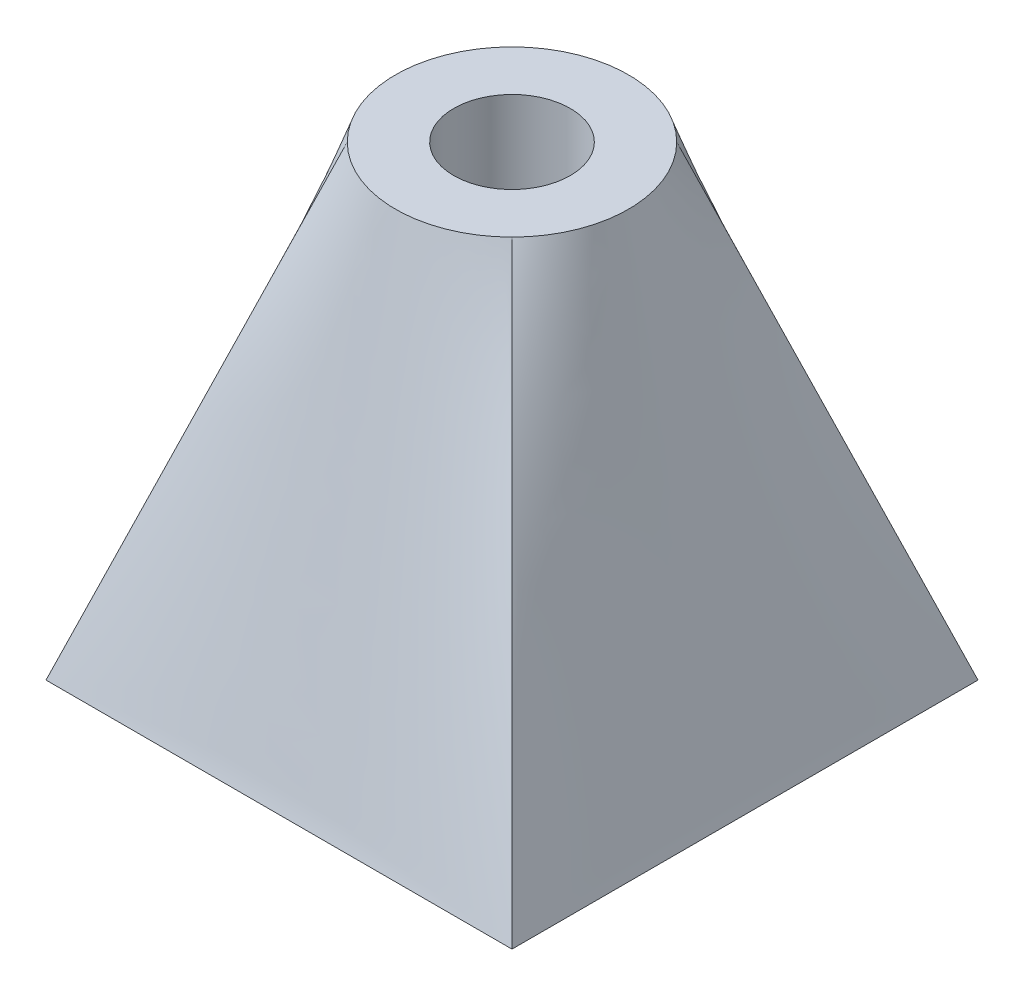
ISO-10303-21;
HEADER;
FILE_DESCRIPTION(('STEP AP214'),'2;1');
FILE_NAME('part.step','',(''),(''),'','','');
FILE_SCHEMA(('AUTOMOTIVE_DESIGN { 1 0 10303 214 1 1 1 1 }'));
ENDSEC;
DATA;
#1=APPLICATION_CONTEXT('core data for automotive mechanical design processes');
#2=APPLICATION_PROTOCOL_DEFINITION('international standard','automotive_design',2000,#1);
#3=PRODUCT_CONTEXT('',#1,'mechanical');
#4=PRODUCT('Part','Part','',(#3));
#5=PRODUCT_RELATED_PRODUCT_CATEGORY('part','',(#4));
#6=PRODUCT_DEFINITION_FORMATION('','',#4);
#7=PRODUCT_DEFINITION_CONTEXT('part definition',#1,'design');
#8=PRODUCT_DEFINITION('design','',#6,#7);
#9=PRODUCT_DEFINITION_SHAPE('','',#8);
#10=(LENGTH_UNIT() NAMED_UNIT(*) SI_UNIT(.MILLI.,.METRE.));
#11=(NAMED_UNIT(*) PLANE_ANGLE_UNIT() SI_UNIT($,.RADIAN.));
#12=(NAMED_UNIT(*) SI_UNIT($,.STERADIAN.) SOLID_ANGLE_UNIT());
#13=UNCERTAINTY_MEASURE_WITH_UNIT(LENGTH_MEASURE(1.E-05),#10,'distance_accuracy_value','');
#14=(GEOMETRIC_REPRESENTATION_CONTEXT(3) GLOBAL_UNCERTAINTY_ASSIGNED_CONTEXT((#13)) GLOBAL_UNIT_ASSIGNED_CONTEXT((#10,
#11,#12)) REPRESENTATION_CONTEXT('',''));
#15=CARTESIAN_POINT('',(0.,0.,0.));
#16=DIRECTION('',(0.,0.,1.));
#17=DIRECTION('',(1.,0.,0.));
#18=AXIS2_PLACEMENT_3D('',#15,#16,#17);
#19=CARTESIAN_POINT('',(20.,40.,-20.));
#20=DIRECTION('',(0.,1.,0.));
#21=DIRECTION('',(0.,0.,1.));
#22=AXIS2_PLACEMENT_3D('',#19,#20,#21);
#23=PLANE('',#22);
#24=CARTESIAN_POINT('',(20.,40.,-20.));
#25=DIRECTION('',(0.,1.,0.));
#26=DIRECTION('',(0.,0.,1.));
#27=AXIS2_PLACEMENT_3D('',#24,#25,#26);
#28=CIRCLE('',#27,5.);
#29=CARTESIAN_POINT('',(20.,40.,-15.));
#30=VERTEX_POINT('',#29);
#31=EDGE_CURVE('E301',#30,#30,#28,.T.);
#32=ORIENTED_EDGE('',*,*,#31,.F.);
#33=EDGE_LOOP('',(#32));
#34=FACE_BOUND('',#33,.T.);
#35=CARTESIAN_POINT('',(20.,40.,-20.));
#36=DIRECTION('',(0.,1.,0.));
#37=DIRECTION('',(0.,0.,1.));
#38=AXIS2_PLACEMENT_3D('',#35,#36,#37);
#39=CIRCLE('',#38,10.);
#40=CARTESIAN_POINT('',(12.9289321881345,40.,-27.0710678118655));
#41=VERTEX_POINT('',#40);
#42=CARTESIAN_POINT('',(12.9289321881345,40.,-12.9289321881345));
#43=VERTEX_POINT('',#42);
#44=EDGE_CURVE('E12',#41,#43,#39,.T.);
#45=ORIENTED_EDGE('',*,*,#44,.T.);
#46=CARTESIAN_POINT('',(27.0710678118655,40.,-12.9289321881345));
#47=VERTEX_POINT('',#46);
#48=EDGE_CURVE('E78',#43,#47,#39,.T.);
#49=ORIENTED_EDGE('',*,*,#48,.T.);
#50=CARTESIAN_POINT('',(27.0710678118655,40.,-27.0710678118655));
#51=VERTEX_POINT('',#50);
#52=EDGE_CURVE('E211',#47,#51,#39,.T.);
#53=ORIENTED_EDGE('',*,*,#52,.T.);
#54=EDGE_CURVE('E203',#51,#41,#39,.T.);
#55=ORIENTED_EDGE('',*,*,#54,.T.);
#56=EDGE_LOOP('',(#45,#49,#53,#55));
#57=FACE_BOUND('',#56,.T.);
#58=ADVANCED_FACE('F69',(#34,#57),#23,.T.);
#59=CARTESIAN_POINT('',(0.,0.,0.));
#60=DIRECTION('',(0.,-1.,0.));
#61=DIRECTION('',(0.,0.,-1.));
#62=AXIS2_PLACEMENT_3D('',#59,#60,#61);
#63=PLANE('',#62);
#64=CARTESIAN_POINT('',(20.,0.,-20.));
#65=DIRECTION('',(0.,-1.,0.));
#66=DIRECTION('',(0.,0.,-1.));
#67=AXIS2_PLACEMENT_3D('',#64,#65,#66);
#68=CIRCLE('',#67,5.);
#69=CARTESIAN_POINT('',(20.,0.,-25.));
#70=VERTEX_POINT('',#69);
#71=EDGE_CURVE('E73',#70,#70,#68,.T.);
#72=ORIENTED_EDGE('',*,*,#71,.F.);
#73=EDGE_LOOP('',(#72));
#74=FACE_BOUND('',#73,.T.);
#75=DIRECTION('',(0.,0.,1.));
#76=VECTOR('',#75,1.);
#77=CARTESIAN_POINT('',(0.,0.,0.));
#78=LINE('',#77,#76);
#79=CARTESIAN_POINT('',(0.,0.,-40.));
#80=VERTEX_POINT('',#79);
#81=CARTESIAN_POINT('',(0.,0.,0.));
#82=VERTEX_POINT('',#81);
#83=EDGE_CURVE('E116',#80,#82,#78,.T.);
#84=ORIENTED_EDGE('',*,*,#83,.F.);
#85=DIRECTION('',(-1.,0.,0.));
#86=VECTOR('',#85,1.);
#87=CARTESIAN_POINT('',(0.,0.,-40.));
#88=LINE('',#87,#86);
#89=CARTESIAN_POINT('',(40.,0.,-40.));
#90=VERTEX_POINT('',#89);
#91=EDGE_CURVE('E134',#90,#80,#88,.T.);
#92=ORIENTED_EDGE('',*,*,#91,.F.);
#93=DIRECTION('',(0.,0.,-1.));
#94=VECTOR('',#93,1.);
#95=CARTESIAN_POINT('',(40.,0.,0.));
#96=LINE('',#95,#94);
#97=CARTESIAN_POINT('',(40.,0.,0.));
#98=VERTEX_POINT('',#97);
#99=EDGE_CURVE('E118',#98,#90,#96,.T.);
#100=ORIENTED_EDGE('',*,*,#99,.F.);
#101=DIRECTION('',(1.,0.,0.));
#102=VECTOR('',#101,1.);
#103=CARTESIAN_POINT('',(0.,0.,0.));
#104=LINE('',#103,#102);
#105=EDGE_CURVE('E111',#82,#98,#104,.T.);
#106=ORIENTED_EDGE('',*,*,#105,.F.);
#107=EDGE_LOOP('',(#84,#92,#100,#106));
#108=FACE_BOUND('',#107,.T.);
#109=ADVANCED_FACE('F114',(#74,#108),#63,.T.);
#110=CARTESIAN_POINT('',(0.,0.,0.));
#111=CARTESIAN_POINT('',(12.9289321881345,40.,-12.9289321881345));
#112=CARTESIAN_POINT('',(1.66666666666666,0.,0.));
#113=CARTESIAN_POINT('',(13.3455988548012,40.,-12.5122655214679));
#114=CARTESIAN_POINT('',(3.33333333333332,0.,0.));
#115=CARTESIAN_POINT('',(13.8148880901744,40.,-12.1170577036388));
#116=CARTESIAN_POINT('',(6.66666666666665,0.,0.));
#117=CARTESIAN_POINT('',(14.8524201958563,40.,-11.4035582509507));
#118=CARTESIAN_POINT('',(8.33333333333331,0.,0.));
#119=CARTESIAN_POINT('',(15.420716050355,40.,-11.0854976289514));
#120=CARTESIAN_POINT('',(11.6666666666666,0.,0.));
#121=CARTESIAN_POINT('',(16.6357369996636,40.,-10.5596648110634));
#122=CARTESIAN_POINT('',(13.3333333333333,0.,0.));
#123=CARTESIAN_POINT('',(17.2823669694459,40.,-10.3521503508506));
#124=CARTESIAN_POINT('',(16.6666666666667,0.,0.));
#125=CARTESIAN_POINT('',(18.619443541447,40.,-10.0722310660401));
#126=CARTESIAN_POINT('',(18.3333333333333,0.,0.));
#127=CARTESIAN_POINT('',(19.3096440627115,40.,-10.));
#128=CARTESIAN_POINT('',(21.6666666666667,0.,0.));
#129=CARTESIAN_POINT('',(20.6903559372885,40.,-10.));
#130=CARTESIAN_POINT('',(23.3333333333333,0.,0.));
#131=CARTESIAN_POINT('',(21.380556458553,40.,-10.0722310660401));
#132=CARTESIAN_POINT('',(26.6666666666667,0.,0.));
#133=CARTESIAN_POINT('',(22.7176330305541,40.,-10.3521503508506));
#134=CARTESIAN_POINT('',(28.3333333333333,0.,0.));
#135=CARTESIAN_POINT('',(23.3642630003365,40.,-10.5596648110634));
#136=CARTESIAN_POINT('',(31.6666666666667,0.,0.));
#137=CARTESIAN_POINT('',(24.579283949645,40.,-11.0854976289514));
#138=CARTESIAN_POINT('',(33.3333333333333,0.,0.));
#139=CARTESIAN_POINT('',(25.1475798041437,40.,-11.4035582509507));
#140=CARTESIAN_POINT('',(36.6666666666667,0.,0.));
#141=CARTESIAN_POINT('',(26.1851119098256,40.,-12.1170577036388));
#142=CARTESIAN_POINT('',(38.3333333333333,0.,0.));
#143=CARTESIAN_POINT('',(26.6544011451988,40.,-12.5122655214679));
#144=CARTESIAN_POINT('',(40.,0.,0.));
#145=CARTESIAN_POINT('',(27.0710678118655,40.,-12.9289321881345));
#146=B_SPLINE_SURFACE_WITH_KNOTS('',3,1,((#110,#111),(#112,#113),(#114,#115),(#116,#117),(#118,
#119),(#120,#121),(#122,#123),(#124,#125),(#126,#127),(#128,#129),(#130,#131),(#132,#133),(#134,
#135),(#136,#137),(#138,#139),(#140,#141),(#142,#143),(#144,#145)),.UNSPECIFIED.,.F.,.F.,.F.,(4,
2,2,2,2,2,2,2,4),(2,2),(0.,0.125,0.249999999999999,0.374999999999999,0.5,0.624999999999999,0.75,
0.875,1.),(0.,1.),.UNSPECIFIED.);
#147=DIRECTION('',(-0.2939673554626,0.909486881623177,-0.2939673554626));
#148=VECTOR('',#147,1.);
#149=CARTESIAN_POINT('',(33.5355339059327,20.,-6.46446609406726));
#150=LINE('',#149,#148);
#151=EDGE_CURVE('E140',#98,#47,#150,.T.);
#152=DIRECTION('',(-0.2939673554626,-0.909486881623177,0.2939673554626));
#153=VECTOR('',#152,1.);
#154=CARTESIAN_POINT('',(6.46446609406726,20.,-6.46446609406726));
#155=LINE('',#154,#153);
#156=EDGE_CURVE('E124',#43,#82,#155,.T.);
#157=ORIENTED_EDGE('',*,*,#105,.T.);
#158=ORIENTED_EDGE('',*,*,#151,.T.);
#159=ORIENTED_EDGE('',*,*,#48,.F.);
#160=ORIENTED_EDGE('',*,*,#156,.T.);
#161=EDGE_LOOP('',(#157,#158,#159,#160));
#162=FACE_BOUND('',#161,.T.);
#163=ADVANCED_FACE('F138',(#162),#146,.T.);
#164=CARTESIAN_POINT('',(40.,0.,0.));
#165=CARTESIAN_POINT('',(27.0710678118655,40.,-12.9289321881345));
#166=CARTESIAN_POINT('',(40.,0.,-1.66666666666666));
#167=CARTESIAN_POINT('',(27.4877344785321,40.,-13.3455988548012));
#168=CARTESIAN_POINT('',(40.,0.,-3.33333333333331));
#169=CARTESIAN_POINT('',(27.8829422963612,40.,-13.8148880901744));
#170=CARTESIAN_POINT('',(40.,0.,-6.66666666666663));
#171=CARTESIAN_POINT('',(28.5964417490493,40.,-14.8524201958563));
#172=CARTESIAN_POINT('',(40.,0.,-8.33333333333329));
#173=CARTESIAN_POINT('',(28.9145023710486,40.,-15.420716050355));
#174=CARTESIAN_POINT('',(40.,0.,-11.6666666666666));
#175=CARTESIAN_POINT('',(29.4403351889366,40.,-16.6357369996636));
#176=CARTESIAN_POINT('',(40.,0.,-13.3333333333333));
#177=CARTESIAN_POINT('',(29.6478496491494,40.,-17.2823669694459));
#178=CARTESIAN_POINT('',(40.,0.,-16.6666666666666));
#179=CARTESIAN_POINT('',(29.9277689339599,40.,-18.619443541447));
#180=CARTESIAN_POINT('',(40.,0.,-18.3333333333333));
#181=CARTESIAN_POINT('',(30.,40.,-19.3096440627115));
#182=CARTESIAN_POINT('',(40.,0.,-21.6666666666666));
#183=CARTESIAN_POINT('',(30.,40.,-20.6903559372885));
#184=CARTESIAN_POINT('',(40.,0.,-23.3333333333333));
#185=CARTESIAN_POINT('',(29.9277689339599,40.,-21.380556458553));
#186=CARTESIAN_POINT('',(40.,0.,-26.6666666666666));
#187=CARTESIAN_POINT('',(29.6478496491494,40.,-22.7176330305541));
#188=CARTESIAN_POINT('',(40.,0.,-28.3333333333333));
#189=CARTESIAN_POINT('',(29.4403351889366,40.,-23.3642630003365));
#190=CARTESIAN_POINT('',(40.,0.,-31.6666666666666));
#191=CARTESIAN_POINT('',(28.9145023710486,40.,-24.579283949645));
#192=CARTESIAN_POINT('',(40.,0.,-33.3333333333333));
#193=CARTESIAN_POINT('',(28.5964417490493,40.,-25.1475798041437));
#194=CARTESIAN_POINT('',(40.,0.,-36.6666666666667));
#195=CARTESIAN_POINT('',(27.8829422963612,40.,-26.1851119098256));
#196=CARTESIAN_POINT('',(40.,0.,-38.3333333333333));
#197=CARTESIAN_POINT('',(27.4877344785321,40.,-26.6544011451988));
#198=CARTESIAN_POINT('',(40.,0.,-40.));
#199=CARTESIAN_POINT('',(27.0710678118655,40.,-27.0710678118655));
#200=B_SPLINE_SURFACE_WITH_KNOTS('',3,1,((#164,#165),(#166,#167),(#168,#169),(#170,#171),(#172,
#173),(#174,#175),(#176,#177),(#178,#179),(#180,#181),(#182,#183),(#184,#185),(#186,#187),(#188,
#189),(#190,#191),(#192,#193),(#194,#195),(#196,#197),(#198,#199)),.UNSPECIFIED.,.F.,.F.,.F.,(4,
2,2,2,2,2,2,2,4),(2,2),(0.,0.125,0.249999999999999,0.374999999999999,0.5,0.624999999999999,0.75,
0.875,1.),(0.,1.),.UNSPECIFIED.);
#201=DIRECTION('',(-0.2939673554626,0.909486881623177,0.2939673554626));
#202=VECTOR('',#201,1.);
#203=CARTESIAN_POINT('',(33.5355339059327,20.,-33.5355339059327));
#204=LINE('',#203,#202);
#205=EDGE_CURVE('E142',#90,#51,#204,.T.);
#206=ORIENTED_EDGE('',*,*,#99,.T.);
#207=ORIENTED_EDGE('',*,*,#205,.T.);
#208=ORIENTED_EDGE('',*,*,#52,.F.);
#209=ORIENTED_EDGE('',*,*,#151,.F.);
#210=EDGE_LOOP('',(#206,#207,#208,#209));
#211=FACE_BOUND('',#210,.T.);
#212=ADVANCED_FACE('F162',(#211),#200,.T.);
#213=CARTESIAN_POINT('',(0.,0.,-40.));
#214=CARTESIAN_POINT('',(12.9289321881345,40.,-27.0710678118655));
#215=CARTESIAN_POINT('',(0.,0.,-38.3333333333333));
#216=CARTESIAN_POINT('',(12.5122655214679,40.,-26.6544011451988));
#217=CARTESIAN_POINT('',(0.,0.,-36.6666666666667));
#218=CARTESIAN_POINT('',(12.1170577036388,40.,-26.1851119098256));
#219=CARTESIAN_POINT('',(0.,0.,-33.3333333333334));
#220=CARTESIAN_POINT('',(11.4035582509507,40.,-25.1475798041437));
#221=CARTESIAN_POINT('',(0.,0.,-31.6666666666667));
#222=CARTESIAN_POINT('',(11.0854976289514,40.,-24.579283949645));
#223=CARTESIAN_POINT('',(0.,0.,-28.3333333333334));
#224=CARTESIAN_POINT('',(10.5596648110634,40.,-23.3642630003365));
#225=CARTESIAN_POINT('',(0.,0.,-26.6666666666667));
#226=CARTESIAN_POINT('',(10.3521503508506,40.,-22.7176330305541));
#227=CARTESIAN_POINT('',(0.,0.,-23.3333333333334));
#228=CARTESIAN_POINT('',(10.0722310660401,40.,-21.380556458553));
#229=CARTESIAN_POINT('',(0.,0.,-21.6666666666667));
#230=CARTESIAN_POINT('',(10.,40.,-20.6903559372885));
#231=CARTESIAN_POINT('',(0.,0.,-18.3333333333334));
#232=CARTESIAN_POINT('',(10.,40.,-19.3096440627115));
#233=CARTESIAN_POINT('',(0.,0.,-16.6666666666667));
#234=CARTESIAN_POINT('',(10.0722310660401,40.,-18.619443541447));
#235=CARTESIAN_POINT('',(0.,0.,-13.3333333333334));
#236=CARTESIAN_POINT('',(10.3521503508506,40.,-17.2823669694459));
#237=CARTESIAN_POINT('',(0.,0.,-11.6666666666667));
#238=CARTESIAN_POINT('',(10.5596648110634,40.,-16.6357369996636));
#239=CARTESIAN_POINT('',(0.,0.,-8.33333333333336));
#240=CARTESIAN_POINT('',(11.0854976289514,40.,-15.420716050355));
#241=CARTESIAN_POINT('',(0.,0.,-6.66666666666669));
#242=CARTESIAN_POINT('',(11.4035582509507,40.,-14.8524201958563));
#243=CARTESIAN_POINT('',(0.,0.,-3.33333333333335));
#244=CARTESIAN_POINT('',(12.1170577036388,40.,-13.8148880901744));
#245=CARTESIAN_POINT('',(0.,0.,-1.66666666666667));
#246=CARTESIAN_POINT('',(12.5122655214679,40.,-13.3455988548012));
#247=CARTESIAN_POINT('',(0.,0.,0.));
#248=CARTESIAN_POINT('',(12.9289321881345,40.,-12.9289321881345));
#249=B_SPLINE_SURFACE_WITH_KNOTS('',3,1,((#213,#214),(#215,#216),(#217,#218),(#219,#220),(#221,
#222),(#223,#224),(#225,#226),(#227,#228),(#229,#230),(#231,#232),(#233,#234),(#235,#236),(#237,
#238),(#239,#240),(#241,#242),(#243,#244),(#245,#246),(#247,#248)),.UNSPECIFIED.,.F.,.F.,.F.,(4,
2,2,2,2,2,2,2,4),(2,2),(0.,0.125,0.25,0.375,0.5,0.625000000000001,0.750000000000001,0.875,1.),
(0.,1.),.UNSPECIFIED.);
#250=DIRECTION('',(0.2939673554626,0.909486881623177,0.2939673554626));
#251=VECTOR('',#250,1.);
#252=CARTESIAN_POINT('',(6.46446609406726,20.,-33.5355339059327));
#253=LINE('',#252,#251);
#254=EDGE_CURVE('E133',#80,#41,#253,.T.);
#255=ORIENTED_EDGE('',*,*,#83,.T.);
#256=ORIENTED_EDGE('',*,*,#156,.F.);
#257=ORIENTED_EDGE('',*,*,#44,.F.);
#258=ORIENTED_EDGE('',*,*,#254,.F.);
#259=EDGE_LOOP('',(#255,#256,#257,#258));
#260=FACE_BOUND('',#259,.T.);
#261=ADVANCED_FACE('F132',(#260),#249,.T.);
#262=CARTESIAN_POINT('',(40.,0.,-40.));
#263=CARTESIAN_POINT('',(27.0710678118655,40.,-27.0710678118655));
#264=CARTESIAN_POINT('',(38.3333333333333,0.,-40.));
#265=CARTESIAN_POINT('',(26.6544011451988,40.,-27.4877344785321));
#266=CARTESIAN_POINT('',(36.6666666666667,0.,-40.));
#267=CARTESIAN_POINT('',(26.1851119098256,40.,-27.8829422963612));
#268=CARTESIAN_POINT('',(33.3333333333333,0.,-40.));
#269=CARTESIAN_POINT('',(25.1475798041437,40.,-28.5964417490493));
#270=CARTESIAN_POINT('',(31.6666666666667,0.,-40.));
#271=CARTESIAN_POINT('',(24.579283949645,40.,-28.9145023710486));
#272=CARTESIAN_POINT('',(28.3333333333333,0.,-40.));
#273=CARTESIAN_POINT('',(23.3642630003365,40.,-29.4403351889366));
#274=CARTESIAN_POINT('',(26.6666666666667,0.,-40.));
#275=CARTESIAN_POINT('',(22.7176330305541,40.,-29.6478496491494));
#276=CARTESIAN_POINT('',(23.3333333333333,0.,-40.));
#277=CARTESIAN_POINT('',(21.380556458553,40.,-29.9277689339598));
#278=CARTESIAN_POINT('',(21.6666666666667,0.,-40.));
#279=CARTESIAN_POINT('',(20.6903559372885,40.,-30.));
#280=CARTESIAN_POINT('',(18.3333333333333,0.,-40.));
#281=CARTESIAN_POINT('',(19.3096440627115,40.,-30.));
#282=CARTESIAN_POINT('',(16.6666666666667,0.,-40.));
#283=CARTESIAN_POINT('',(18.619443541447,40.,-29.9277689339599));
#284=CARTESIAN_POINT('',(13.3333333333333,0.,-40.));
#285=CARTESIAN_POINT('',(17.2823669694459,40.,-29.6478496491494));
#286=CARTESIAN_POINT('',(11.6666666666667,0.,-40.));
#287=CARTESIAN_POINT('',(16.6357369996636,40.,-29.4403351889366));
#288=CARTESIAN_POINT('',(8.33333333333332,0.,-40.));
#289=CARTESIAN_POINT('',(15.420716050355,40.,-28.9145023710486));
#290=CARTESIAN_POINT('',(6.66666666666666,0.,-40.));
#291=CARTESIAN_POINT('',(14.8524201958563,40.,-28.5964417490493));
#292=CARTESIAN_POINT('',(3.33333333333333,0.,-40.));
#293=CARTESIAN_POINT('',(13.8148880901744,40.,-27.8829422963612));
#294=CARTESIAN_POINT('',(1.66666666666666,0.,-40.));
#295=CARTESIAN_POINT('',(13.3455988548012,40.,-27.4877344785321));
#296=CARTESIAN_POINT('',(0.,0.,-40.));
#297=CARTESIAN_POINT('',(12.9289321881345,40.,-27.0710678118655));
#298=B_SPLINE_SURFACE_WITH_KNOTS('',3,1,((#262,#263),(#264,#265),(#266,#267),(#268,#269),(#270,
#271),(#272,#273),(#274,#275),(#276,#277),(#278,#279),(#280,#281),(#282,#283),(#284,#285),(#286,
#287),(#288,#289),(#290,#291),(#292,#293),(#294,#295),(#296,#297)),.UNSPECIFIED.,.F.,.F.,.F.,(4,
2,2,2,2,2,2,2,4),(2,2),(0.,0.125,0.25,0.375,0.5,0.625000000000001,0.750000000000001,0.875,1.),
(0.,1.),.UNSPECIFIED.);
#299=ORIENTED_EDGE('',*,*,#91,.T.);
#300=ORIENTED_EDGE('',*,*,#254,.T.);
#301=ORIENTED_EDGE('',*,*,#54,.F.);
#302=ORIENTED_EDGE('',*,*,#205,.F.);
#303=EDGE_LOOP('',(#299,#300,#301,#302));
#304=FACE_BOUND('',#303,.T.);
#305=ADVANCED_FACE('F239',(#304),#298,.T.);
#306=CARTESIAN_POINT('',(20.,-0.00168558212507164,-20.));
#307=DIRECTION('',(0.,1.,0.));
#308=DIRECTION('',(0.,0.,1.));
#309=AXIS2_PLACEMENT_3D('',#306,#307,#308);
#310=CYLINDRICAL_SURFACE('',#309,5.);
#311=ORIENTED_EDGE('',*,*,#71,.T.);
#312=EDGE_LOOP('',(#311));
#313=FACE_BOUND('',#312,.T.);
#314=ORIENTED_EDGE('',*,*,#31,.T.);
#315=EDGE_LOOP('',(#314));
#316=FACE_BOUND('',#315,.T.);
#317=ADVANCED_FACE('F249',(#313,#316),#310,.F.);
#318=CLOSED_SHELL('',(#58,#109,#163,#212,#261,#305,#317));
#319=MANIFOLD_SOLID_BREP('B2',#318);
#320=ADVANCED_BREP_SHAPE_REPRESENTATION('',(#18,#319),#14);
#321=SHAPE_DEFINITION_REPRESENTATION(#9,#320);
ENDSEC;
END-ISO-10303-21;
